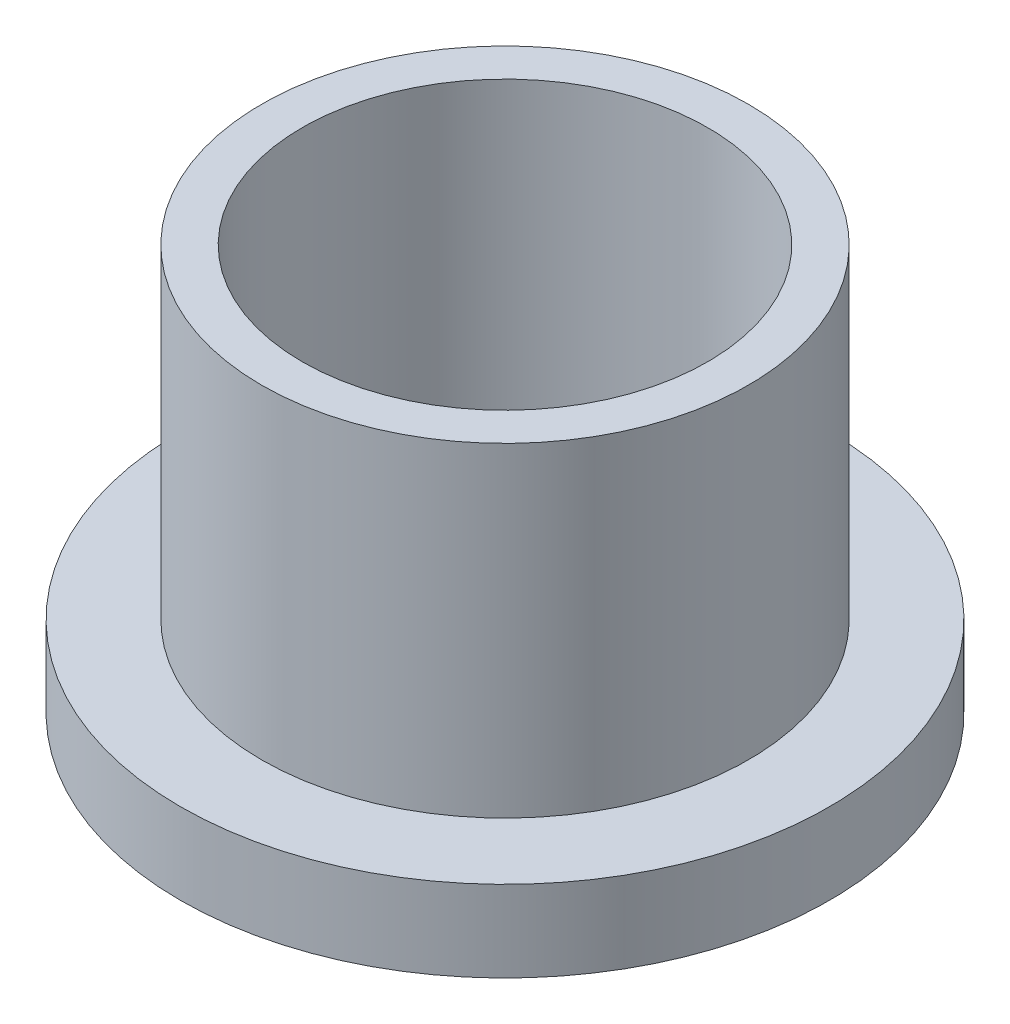
ISO-10303-21;
HEADER;
FILE_DESCRIPTION(('STEP AP214'),'2;1');
FILE_NAME('part.step','',(''),(''),'','','');
FILE_SCHEMA(('AUTOMOTIVE_DESIGN { 1 0 10303 214 1 1 1 1 }'));
ENDSEC;
DATA;
#1=APPLICATION_CONTEXT('core data for automotive mechanical design processes');
#2=APPLICATION_PROTOCOL_DEFINITION('international standard','automotive_design',2000,#1);
#3=PRODUCT_CONTEXT('',#1,'mechanical');
#4=PRODUCT('Part','Part','',(#3));
#5=PRODUCT_RELATED_PRODUCT_CATEGORY('part','',(#4));
#6=PRODUCT_DEFINITION_FORMATION('','',#4);
#7=PRODUCT_DEFINITION_CONTEXT('part definition',#1,'design');
#8=PRODUCT_DEFINITION('design','',#6,#7);
#9=PRODUCT_DEFINITION_SHAPE('','',#8);
#10=(LENGTH_UNIT() NAMED_UNIT(*) SI_UNIT(.MILLI.,.METRE.));
#11=(NAMED_UNIT(*) PLANE_ANGLE_UNIT() SI_UNIT($,.RADIAN.));
#12=(NAMED_UNIT(*) SI_UNIT($,.STERADIAN.) SOLID_ANGLE_UNIT());
#13=UNCERTAINTY_MEASURE_WITH_UNIT(LENGTH_MEASURE(1.E-05),#10,'distance_accuracy_value','');
#14=(GEOMETRIC_REPRESENTATION_CONTEXT(3) GLOBAL_UNCERTAINTY_ASSIGNED_CONTEXT((#13)) GLOBAL_UNIT_ASSIGNED_CONTEXT((#10,
#11,#12)) REPRESENTATION_CONTEXT('',''));
#15=CARTESIAN_POINT('',(0.,0.,0.));
#16=DIRECTION('',(0.,0.,1.));
#17=DIRECTION('',(1.,0.,0.));
#18=AXIS2_PLACEMENT_3D('',#15,#16,#17);
#19=CARTESIAN_POINT('',(0.,15.875,0.));
#20=DIRECTION('',(0.,1.,0.));
#21=DIRECTION('',(0.,0.,1.));
#22=AXIS2_PLACEMENT_3D('',#19,#20,#21);
#23=PLANE('',#22);
#24=CARTESIAN_POINT('',(0.,15.875,0.));
#25=DIRECTION('',(0.,1.,0.));
#26=DIRECTION('',(0.,0.,1.));
#27=AXIS2_PLACEMENT_3D('',#24,#25,#26);
#28=CIRCLE('',#27,9.525);
#29=CARTESIAN_POINT('',(0.,15.875,9.525));
#30=VERTEX_POINT('',#29);
#31=EDGE_CURVE('E10',#30,#30,#28,.T.);
#32=ORIENTED_EDGE('',*,*,#31,.T.);
#33=EDGE_LOOP('',(#32));
#34=FACE_BOUND('',#33,.T.);
#35=CARTESIAN_POINT('',(0.,15.875,0.));
#36=DIRECTION('',(0.,1.,0.));
#37=DIRECTION('',(0.,0.,1.));
#38=AXIS2_PLACEMENT_3D('',#35,#36,#37);
#39=CIRCLE('',#38,7.9375);
#40=CARTESIAN_POINT('',(0.,15.875,7.9375));
#41=VERTEX_POINT('',#40);
#42=EDGE_CURVE('E37',#41,#41,#39,.T.);
#43=ORIENTED_EDGE('',*,*,#42,.F.);
#44=EDGE_LOOP('',(#43));
#45=FACE_BOUND('',#44,.T.);
#46=ADVANCED_FACE('F30',(#34,#45),#23,.T.);
#47=CARTESIAN_POINT('',(0.,0.,0.));
#48=DIRECTION('',(0.,1.,0.));
#49=DIRECTION('',(0.,0.,1.));
#50=AXIS2_PLACEMENT_3D('',#47,#48,#49);
#51=PLANE('',#50);
#52=CARTESIAN_POINT('',(0.,0.,0.));
#53=DIRECTION('',(0.,1.,0.));
#54=DIRECTION('',(0.,0.,1.));
#55=AXIS2_PLACEMENT_3D('',#52,#53,#54);
#56=CIRCLE('',#55,7.9375);
#57=CARTESIAN_POINT('',(0.,0.,7.9375));
#58=VERTEX_POINT('',#57);
#59=EDGE_CURVE('E41',#58,#58,#56,.T.);
#60=ORIENTED_EDGE('',*,*,#59,.T.);
#61=EDGE_LOOP('',(#60));
#62=FACE_BOUND('',#61,.T.);
#63=CARTESIAN_POINT('',(0.,0.,0.));
#64=DIRECTION('',(0.,1.,0.));
#65=DIRECTION('',(0.,0.,1.));
#66=AXIS2_PLACEMENT_3D('',#63,#64,#65);
#67=CIRCLE('',#66,12.7);
#68=CARTESIAN_POINT('',(0.,0.,12.7));
#69=VERTEX_POINT('',#68);
#70=EDGE_CURVE('E48',#69,#69,#67,.T.);
#71=ORIENTED_EDGE('',*,*,#70,.F.);
#72=EDGE_LOOP('',(#71));
#73=FACE_BOUND('',#72,.T.);
#74=ADVANCED_FACE('F73',(#62,#73),#51,.F.);
#75=CARTESIAN_POINT('',(0.,15.875,0.));
#76=DIRECTION('',(0.,-1.,0.));
#77=DIRECTION('',(0.,0.,-1.));
#78=AXIS2_PLACEMENT_3D('',#75,#76,#77);
#79=CYLINDRICAL_SURFACE('',#78,9.525);
#80=CARTESIAN_POINT('',(0.,3.175,0.));
#81=DIRECTION('',(0.,1.,0.));
#82=DIRECTION('',(0.,0.,1.));
#83=AXIS2_PLACEMENT_3D('',#80,#81,#82);
#84=CIRCLE('',#83,9.525);
#85=CARTESIAN_POINT('',(0.,3.175,9.525));
#86=VERTEX_POINT('',#85);
#87=EDGE_CURVE('E51',#86,#86,#84,.T.);
#88=ORIENTED_EDGE('',*,*,#87,.T.);
#89=EDGE_LOOP('',(#88));
#90=FACE_BOUND('',#89,.T.);
#91=ORIENTED_EDGE('',*,*,#31,.F.);
#92=EDGE_LOOP('',(#91));
#93=FACE_BOUND('',#92,.T.);
#94=ADVANCED_FACE('F32',(#90,#93),#79,.T.);
#95=CARTESIAN_POINT('',(0.,15.875,0.));
#96=DIRECTION('',(0.,-1.,0.));
#97=DIRECTION('',(0.,0.,-1.));
#98=AXIS2_PLACEMENT_3D('',#95,#96,#97);
#99=CYLINDRICAL_SURFACE('',#98,7.9375);
#100=ORIENTED_EDGE('',*,*,#42,.T.);
#101=EDGE_LOOP('',(#100));
#102=FACE_BOUND('',#101,.T.);
#103=ORIENTED_EDGE('',*,*,#59,.F.);
#104=EDGE_LOOP('',(#103));
#105=FACE_BOUND('',#104,.T.);
#106=ADVANCED_FACE('F62',(#102,#105),#99,.F.);
#107=CARTESIAN_POINT('',(0.,3.175,0.));
#108=DIRECTION('',(0.,1.,0.));
#109=DIRECTION('',(0.,0.,1.));
#110=AXIS2_PLACEMENT_3D('',#107,#108,#109);
#111=PLANE('',#110);
#112=CARTESIAN_POINT('',(0.,3.175,0.));
#113=DIRECTION('',(0.,1.,0.));
#114=DIRECTION('',(0.,0.,1.));
#115=AXIS2_PLACEMENT_3D('',#112,#113,#114);
#116=CIRCLE('',#115,12.7);
#117=CARTESIAN_POINT('',(0.,3.175,12.7));
#118=VERTEX_POINT('',#117);
#119=EDGE_CURVE('E46',#118,#118,#116,.T.);
#120=ORIENTED_EDGE('',*,*,#119,.T.);
#121=EDGE_LOOP('',(#120));
#122=FACE_BOUND('',#121,.T.);
#123=ORIENTED_EDGE('',*,*,#87,.F.);
#124=EDGE_LOOP('',(#123));
#125=FACE_BOUND('',#124,.T.);
#126=ADVANCED_FACE('F59',(#122,#125),#111,.T.);
#127=CARTESIAN_POINT('',(0.,3.175,0.));
#128=DIRECTION('',(0.,-1.,0.));
#129=DIRECTION('',(0.,0.,-1.));
#130=AXIS2_PLACEMENT_3D('',#127,#128,#129);
#131=CYLINDRICAL_SURFACE('',#130,12.7);
#132=ORIENTED_EDGE('',*,*,#119,.F.);
#133=EDGE_LOOP('',(#132));
#134=FACE_BOUND('',#133,.T.);
#135=ORIENTED_EDGE('',*,*,#70,.T.);
#136=EDGE_LOOP('',(#135));
#137=FACE_BOUND('',#136,.T.);
#138=ADVANCED_FACE('F61',(#134,#137),#131,.T.);
#139=CLOSED_SHELL('',(#46,#74,#94,#106,#126,#138));
#140=MANIFOLD_SOLID_BREP('B2',#139);
#141=ADVANCED_BREP_SHAPE_REPRESENTATION('',(#18,#140),#14);
#142=SHAPE_DEFINITION_REPRESENTATION(#9,#141);
ENDSEC;
END-ISO-10303-21;
